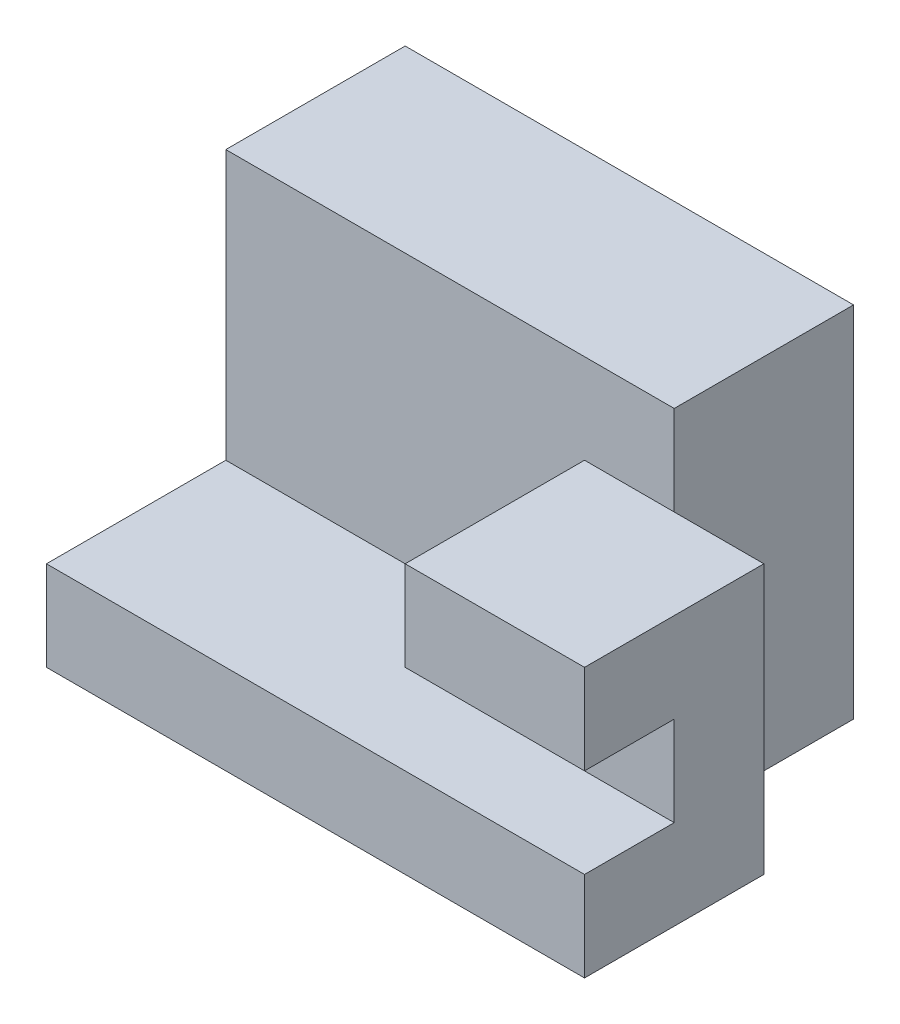
ISO-10303-21;
HEADER;
FILE_DESCRIPTION(('STEP AP214'),'2;1');
FILE_NAME('part.step','',(''),(''),'','','');
FILE_SCHEMA(('AUTOMOTIVE_DESIGN { 1 0 10303 214 1 1 1 1 }'));
ENDSEC;
DATA;
#1=APPLICATION_CONTEXT('core data for automotive mechanical design processes');
#2=APPLICATION_PROTOCOL_DEFINITION('international standard','automotive_design',2000,#1);
#3=PRODUCT_CONTEXT('',#1,'mechanical');
#4=PRODUCT('Part','Part','',(#3));
#5=PRODUCT_RELATED_PRODUCT_CATEGORY('part','',(#4));
#6=PRODUCT_DEFINITION_FORMATION('','',#4);
#7=PRODUCT_DEFINITION_CONTEXT('part definition',#1,'design');
#8=PRODUCT_DEFINITION('design','',#6,#7);
#9=PRODUCT_DEFINITION_SHAPE('','',#8);
#10=(LENGTH_UNIT() NAMED_UNIT(*) SI_UNIT(.MILLI.,.METRE.));
#11=(NAMED_UNIT(*) PLANE_ANGLE_UNIT() SI_UNIT($,.RADIAN.));
#12=(NAMED_UNIT(*) SI_UNIT($,.STERADIAN.) SOLID_ANGLE_UNIT());
#13=UNCERTAINTY_MEASURE_WITH_UNIT(LENGTH_MEASURE(1.E-05),#10,'distance_accuracy_value','');
#14=(GEOMETRIC_REPRESENTATION_CONTEXT(3) GLOBAL_UNCERTAINTY_ASSIGNED_CONTEXT((#13)) GLOBAL_UNIT_ASSIGNED_CONTEXT((#10,
#11,#12)) REPRESENTATION_CONTEXT('',''));
#15=CARTESIAN_POINT('',(0.,0.,0.));
#16=DIRECTION('',(0.,0.,1.));
#17=DIRECTION('',(1.,0.,0.));
#18=AXIS2_PLACEMENT_3D('',#15,#16,#17);
#19=CARTESIAN_POINT('',(0.,4.,0.));
#20=DIRECTION('',(0.,0.,1.));
#21=DIRECTION('',(1.,0.,0.));
#22=AXIS2_PLACEMENT_3D('',#19,#20,#21);
#23=PLANE('',#22);
#24=DIRECTION('',(0.,1.,0.));
#25=VECTOR('',#24,1.);
#26=CARTESIAN_POINT('',(4.,0.,0.));
#27=LINE('',#26,#25);
#28=CARTESIAN_POINT('',(4.,1.,0.));
#29=VERTEX_POINT('',#28);
#30=CARTESIAN_POINT('',(4.,3.,0.));
#31=VERTEX_POINT('',#30);
#32=EDGE_CURVE('E50',#29,#31,#27,.T.);
#33=ORIENTED_EDGE('',*,*,#32,.T.);
#34=DIRECTION('',(1.,0.,0.));
#35=VECTOR('',#34,1.);
#36=CARTESIAN_POINT('',(4.,3.,0.));
#37=LINE('',#36,#35);
#38=CARTESIAN_POINT('',(5.,3.,0.));
#39=VERTEX_POINT('',#38);
#40=EDGE_CURVE('E173',#31,#39,#37,.T.);
#41=ORIENTED_EDGE('',*,*,#40,.T.);
#42=DIRECTION('',(0.,-1.,0.));
#43=VECTOR('',#42,1.);
#44=CARTESIAN_POINT('',(5.,4.,0.));
#45=LINE('',#44,#43);
#46=CARTESIAN_POINT('',(5.,4.,0.));
#47=VERTEX_POINT('',#46);
#48=EDGE_CURVE('E38',#47,#39,#45,.T.);
#49=ORIENTED_EDGE('',*,*,#48,.F.);
#50=DIRECTION('',(-1.,0.,0.));
#51=VECTOR('',#50,1.);
#52=CARTESIAN_POINT('',(0.,4.,0.));
#53=LINE('',#52,#51);
#54=CARTESIAN_POINT('',(0.,4.,0.));
#55=VERTEX_POINT('',#54);
#56=EDGE_CURVE('E199',#47,#55,#53,.T.);
#57=ORIENTED_EDGE('',*,*,#56,.T.);
#58=DIRECTION('',(0.,-1.,0.));
#59=VECTOR('',#58,1.);
#60=CARTESIAN_POINT('',(0.,4.,0.));
#61=LINE('',#60,#59);
#62=CARTESIAN_POINT('',(0.,1.,0.));
#63=VERTEX_POINT('',#62);
#64=EDGE_CURVE('E212',#55,#63,#61,.T.);
#65=ORIENTED_EDGE('',*,*,#64,.T.);
#66=DIRECTION('',(-1.,0.,0.));
#67=VECTOR('',#66,1.);
#68=CARTESIAN_POINT('',(0.,1.,0.));
#69=LINE('',#68,#67);
#70=EDGE_CURVE('E11',#29,#63,#69,.T.);
#71=ORIENTED_EDGE('',*,*,#70,.F.);
#72=EDGE_LOOP('',(#33,#41,#49,#57,#65,#71));
#73=FACE_BOUND('',#72,.T.);
#74=ADVANCED_FACE('F35',(#73),#23,.T.);
#75=CARTESIAN_POINT('',(5.,4.,0.));
#76=DIRECTION('',(1.,0.,0.));
#77=DIRECTION('',(0.,0.,-1.));
#78=AXIS2_PLACEMENT_3D('',#75,#76,#77);
#79=PLANE('',#78);
#80=DIRECTION('',(0.,0.,1.));
#81=VECTOR('',#80,1.);
#82=CARTESIAN_POINT('',(5.,0.,0.));
#83=LINE('',#82,#81);
#84=CARTESIAN_POINT('',(5.,0.,-2.));
#85=VERTEX_POINT('',#84);
#86=CARTESIAN_POINT('',(5.,0.,0.));
#87=VERTEX_POINT('',#86);
#88=EDGE_CURVE('E198',#85,#87,#83,.T.);
#89=ORIENTED_EDGE('',*,*,#88,.F.);
#90=DIRECTION('',(0.,-1.,0.));
#91=VECTOR('',#90,1.);
#92=CARTESIAN_POINT('',(5.,4.,-2.));
#93=LINE('',#92,#91);
#94=CARTESIAN_POINT('',(5.,4.,-2.));
#95=VERTEX_POINT('',#94);
#96=EDGE_CURVE('E223',#95,#85,#93,.T.);
#97=ORIENTED_EDGE('',*,*,#96,.F.);
#98=DIRECTION('',(0.,0.,1.));
#99=VECTOR('',#98,1.);
#100=CARTESIAN_POINT('',(5.,4.,0.));
#101=LINE('',#100,#99);
#102=EDGE_CURVE('E202',#95,#47,#101,.T.);
#103=ORIENTED_EDGE('',*,*,#102,.T.);
#104=ORIENTED_EDGE('',*,*,#48,.T.);
#105=EDGE_CURVE('E58',#39,#87,#45,.T.);
#106=ORIENTED_EDGE('',*,*,#105,.T.);
#107=EDGE_LOOP('',(#89,#97,#103,#104,#106));
#108=FACE_BOUND('',#107,.T.);
#109=ADVANCED_FACE('F230',(#108),#79,.T.);
#110=CARTESIAN_POINT('',(0.,4.,-2.));
#111=DIRECTION('',(0.,0.,-1.));
#112=DIRECTION('',(-1.,0.,0.));
#113=AXIS2_PLACEMENT_3D('',#110,#111,#112);
#114=PLANE('',#113);
#115=DIRECTION('',(1.,0.,0.));
#116=VECTOR('',#115,1.);
#117=CARTESIAN_POINT('',(0.,0.,-2.));
#118=LINE('',#117,#116);
#119=CARTESIAN_POINT('',(0.,0.,-2.));
#120=VERTEX_POINT('',#119);
#121=EDGE_CURVE('E215',#120,#85,#118,.T.);
#122=ORIENTED_EDGE('',*,*,#121,.F.);
#123=DIRECTION('',(0.,-1.,0.));
#124=VECTOR('',#123,1.);
#125=CARTESIAN_POINT('',(0.,4.,-2.));
#126=LINE('',#125,#124);
#127=CARTESIAN_POINT('',(0.,4.,-2.));
#128=VERTEX_POINT('',#127);
#129=EDGE_CURVE('E222',#128,#120,#126,.T.);
#130=ORIENTED_EDGE('',*,*,#129,.F.);
#131=DIRECTION('',(1.,0.,0.));
#132=VECTOR('',#131,1.);
#133=CARTESIAN_POINT('',(0.,4.,-2.));
#134=LINE('',#133,#132);
#135=EDGE_CURVE('E206',#128,#95,#134,.T.);
#136=ORIENTED_EDGE('',*,*,#135,.T.);
#137=ORIENTED_EDGE('',*,*,#96,.T.);
#138=EDGE_LOOP('',(#122,#130,#136,#137));
#139=FACE_BOUND('',#138,.T.);
#140=ADVANCED_FACE('F251',(#139),#114,.T.);
#141=CARTESIAN_POINT('',(0.,4.,0.));
#142=DIRECTION('',(-1.,0.,0.));
#143=DIRECTION('',(0.,0.,1.));
#144=AXIS2_PLACEMENT_3D('',#141,#142,#143);
#145=PLANE('',#144);
#146=DIRECTION('',(0.,0.,-1.));
#147=VECTOR('',#146,1.);
#148=CARTESIAN_POINT('',(0.,0.,0.));
#149=LINE('',#148,#147);
#150=CARTESIAN_POINT('',(0.,0.,2.));
#151=VERTEX_POINT('',#150);
#152=EDGE_CURVE('E203',#151,#120,#149,.T.);
#153=ORIENTED_EDGE('',*,*,#152,.F.);
#154=DIRECTION('',(0.,-1.,0.));
#155=VECTOR('',#154,1.);
#156=CARTESIAN_POINT('',(0.,1.,2.));
#157=LINE('',#156,#155);
#158=CARTESIAN_POINT('',(0.,1.,2.));
#159=VERTEX_POINT('',#158);
#160=EDGE_CURVE('E192',#159,#151,#157,.T.);
#161=ORIENTED_EDGE('',*,*,#160,.F.);
#162=DIRECTION('',(0.,0.,1.));
#163=VECTOR('',#162,1.);
#164=CARTESIAN_POINT('',(0.,1.,0.));
#165=LINE('',#164,#163);
#166=EDGE_CURVE('E178',#63,#159,#165,.T.);
#167=ORIENTED_EDGE('',*,*,#166,.F.);
#168=ORIENTED_EDGE('',*,*,#64,.F.);
#169=DIRECTION('',(0.,0.,-1.));
#170=VECTOR('',#169,1.);
#171=CARTESIAN_POINT('',(0.,4.,0.));
#172=LINE('',#171,#170);
#173=EDGE_CURVE('E209',#55,#128,#172,.T.);
#174=ORIENTED_EDGE('',*,*,#173,.T.);
#175=ORIENTED_EDGE('',*,*,#129,.T.);
#176=EDGE_LOOP('',(#153,#161,#167,#168,#174,#175));
#177=FACE_BOUND('',#176,.T.);
#178=ADVANCED_FACE('F253',(#177),#145,.T.);
#179=CARTESIAN_POINT('',(0.,4.,0.));
#180=DIRECTION('',(0.,1.,0.));
#181=DIRECTION('',(0.,0.,1.));
#182=AXIS2_PLACEMENT_3D('',#179,#180,#181);
#183=PLANE('',#182);
#184=ORIENTED_EDGE('',*,*,#56,.F.);
#185=ORIENTED_EDGE('',*,*,#102,.F.);
#186=ORIENTED_EDGE('',*,*,#135,.F.);
#187=ORIENTED_EDGE('',*,*,#173,.F.);
#188=EDGE_LOOP('',(#184,#185,#186,#187));
#189=FACE_BOUND('',#188,.T.);
#190=ADVANCED_FACE('F249',(#189),#183,.T.);
#191=CARTESIAN_POINT('',(0.,0.,0.));
#192=DIRECTION('',(0.,1.,0.));
#193=DIRECTION('',(0.,0.,1.));
#194=AXIS2_PLACEMENT_3D('',#191,#192,#193);
#195=PLANE('',#194);
#196=ORIENTED_EDGE('',*,*,#88,.T.);
#197=DIRECTION('',(-1.,0.,0.));
#198=VECTOR('',#197,1.);
#199=CARTESIAN_POINT('',(0.,0.,0.));
#200=LINE('',#199,#198);
#201=CARTESIAN_POINT('',(6.,0.,0.));
#202=VERTEX_POINT('',#201);
#203=EDGE_CURVE('E187',#202,#87,#200,.T.);
#204=ORIENTED_EDGE('',*,*,#203,.F.);
#205=DIRECTION('',(0.,0.,-1.));
#206=VECTOR('',#205,1.);
#207=CARTESIAN_POINT('',(6.,0.,0.));
#208=LINE('',#207,#206);
#209=CARTESIAN_POINT('',(6.,0.,2.));
#210=VERTEX_POINT('',#209);
#211=EDGE_CURVE('E169',#210,#202,#208,.T.);
#212=ORIENTED_EDGE('',*,*,#211,.F.);
#213=DIRECTION('',(1.,0.,0.));
#214=VECTOR('',#213,1.);
#215=CARTESIAN_POINT('',(0.,0.,2.));
#216=LINE('',#215,#214);
#217=EDGE_CURVE('E179',#151,#210,#216,.T.);
#218=ORIENTED_EDGE('',*,*,#217,.F.);
#219=ORIENTED_EDGE('',*,*,#152,.T.);
#220=ORIENTED_EDGE('',*,*,#121,.T.);
#221=EDGE_LOOP('',(#196,#204,#212,#218,#219,#220));
#222=FACE_BOUND('',#221,.T.);
#223=ADVANCED_FACE('F246',(#222),#195,.F.);
#224=CARTESIAN_POINT('',(6.,1.,0.));
#225=DIRECTION('',(-1.,0.,0.));
#226=DIRECTION('',(0.,0.,1.));
#227=AXIS2_PLACEMENT_3D('',#224,#225,#226);
#228=PLANE('',#227);
#229=ORIENTED_EDGE('',*,*,#211,.T.);
#230=DIRECTION('',(0.,-1.,0.));
#231=VECTOR('',#230,1.);
#232=CARTESIAN_POINT('',(6.,1.,0.));
#233=LINE('',#232,#231);
#234=CARTESIAN_POINT('',(6.,3.,0.));
#235=VERTEX_POINT('',#234);
#236=EDGE_CURVE('E195',#235,#202,#233,.T.);
#237=ORIENTED_EDGE('',*,*,#236,.F.);
#238=DIRECTION('',(0.,0.,-1.));
#239=VECTOR('',#238,1.);
#240=CARTESIAN_POINT('',(6.,3.,0.));
#241=LINE('',#240,#239);
#242=CARTESIAN_POINT('',(6.,3.,2.));
#243=VERTEX_POINT('',#242);
#244=EDGE_CURVE('E164',#243,#235,#241,.T.);
#245=ORIENTED_EDGE('',*,*,#244,.F.);
#246=DIRECTION('',(0.,1.,0.));
#247=VECTOR('',#246,1.);
#248=CARTESIAN_POINT('',(6.,0.,2.));
#249=LINE('',#248,#247);
#250=CARTESIAN_POINT('',(6.,2.,2.));
#251=VERTEX_POINT('',#250);
#252=EDGE_CURVE('E149',#251,#243,#249,.T.);
#253=ORIENTED_EDGE('',*,*,#252,.F.);
#254=DIRECTION('',(0.,0.,1.));
#255=VECTOR('',#254,1.);
#256=CARTESIAN_POINT('',(6.,2.,0.));
#257=LINE('',#256,#255);
#258=CARTESIAN_POINT('',(6.,2.,0.999999999999999));
#259=VERTEX_POINT('',#258);
#260=EDGE_CURVE('E161',#259,#251,#257,.T.);
#261=ORIENTED_EDGE('',*,*,#260,.F.);
#262=DIRECTION('',(0.,-1.,0.));
#263=VECTOR('',#262,1.);
#264=CARTESIAN_POINT('',(6.,0.,1.));
#265=LINE('',#264,#263);
#266=CARTESIAN_POINT('',(6.,1.,0.999999999999999));
#267=VERTEX_POINT('',#266);
#268=EDGE_CURVE('E135',#259,#267,#265,.T.);
#269=ORIENTED_EDGE('',*,*,#268,.T.);
#270=DIRECTION('',(0.,0.,-1.));
#271=VECTOR('',#270,1.);
#272=CARTESIAN_POINT('',(6.,1.,0.));
#273=LINE('',#272,#271);
#274=CARTESIAN_POINT('',(6.,1.,2.));
#275=VERTEX_POINT('',#274);
#276=EDGE_CURVE('E177',#275,#267,#273,.T.);
#277=ORIENTED_EDGE('',*,*,#276,.F.);
#278=DIRECTION('',(0.,-1.,0.));
#279=VECTOR('',#278,1.);
#280=CARTESIAN_POINT('',(6.,1.,2.));
#281=LINE('',#280,#279);
#282=EDGE_CURVE('E184',#275,#210,#281,.T.);
#283=ORIENTED_EDGE('',*,*,#282,.T.);
#284=EDGE_LOOP('',(#229,#237,#245,#253,#261,#269,#277,#283));
#285=FACE_BOUND('',#284,.T.);
#286=ADVANCED_FACE('F241',(#285),#228,.F.);
#287=CARTESIAN_POINT('',(0.,1.,0.));
#288=DIRECTION('',(0.,0.,1.));
#289=DIRECTION('',(1.,0.,0.));
#290=AXIS2_PLACEMENT_3D('',#287,#288,#289);
#291=PLANE('',#290);
#292=ORIENTED_EDGE('',*,*,#105,.F.);
#293=EDGE_CURVE('E175',#39,#235,#37,.T.);
#294=ORIENTED_EDGE('',*,*,#293,.T.);
#295=ORIENTED_EDGE('',*,*,#236,.T.);
#296=ORIENTED_EDGE('',*,*,#203,.T.);
#297=EDGE_LOOP('',(#292,#294,#295,#296));
#298=FACE_BOUND('',#297,.T.);
#299=ADVANCED_FACE('F238',(#298),#291,.F.);
#300=CARTESIAN_POINT('',(0.,1.,2.));
#301=DIRECTION('',(0.,0.,-1.));
#302=DIRECTION('',(-1.,0.,0.));
#303=AXIS2_PLACEMENT_3D('',#300,#301,#302);
#304=PLANE('',#303);
#305=ORIENTED_EDGE('',*,*,#217,.T.);
#306=ORIENTED_EDGE('',*,*,#282,.F.);
#307=DIRECTION('',(1.,0.,0.));
#308=VECTOR('',#307,1.);
#309=CARTESIAN_POINT('',(0.,1.,2.));
#310=LINE('',#309,#308);
#311=EDGE_CURVE('E182',#159,#275,#310,.T.);
#312=ORIENTED_EDGE('',*,*,#311,.F.);
#313=ORIENTED_EDGE('',*,*,#160,.T.);
#314=EDGE_LOOP('',(#305,#306,#312,#313));
#315=FACE_BOUND('',#314,.T.);
#316=ADVANCED_FACE('F275',(#315),#304,.F.);
#317=CARTESIAN_POINT('',(0.,1.,0.));
#318=DIRECTION('',(0.,1.,0.));
#319=DIRECTION('',(0.,0.,1.));
#320=AXIS2_PLACEMENT_3D('',#317,#318,#319);
#321=PLANE('',#320);
#322=DIRECTION('',(1.,0.,0.));
#323=VECTOR('',#322,1.);
#324=CARTESIAN_POINT('',(4.,1.,1.));
#325=LINE('',#324,#323);
#326=CARTESIAN_POINT('',(4.,1.,1.));
#327=VERTEX_POINT('',#326);
#328=EDGE_CURVE('E139',#327,#267,#325,.T.);
#329=ORIENTED_EDGE('',*,*,#328,.F.);
#330=DIRECTION('',(0.,0.,1.));
#331=VECTOR('',#330,1.);
#332=CARTESIAN_POINT('',(4.,1.,0.));
#333=LINE('',#332,#331);
#334=EDGE_CURVE('E153',#29,#327,#333,.T.);
#335=ORIENTED_EDGE('',*,*,#334,.F.);
#336=ORIENTED_EDGE('',*,*,#70,.T.);
#337=ORIENTED_EDGE('',*,*,#166,.T.);
#338=ORIENTED_EDGE('',*,*,#311,.T.);
#339=ORIENTED_EDGE('',*,*,#276,.T.);
#340=EDGE_LOOP('',(#329,#335,#336,#337,#338,#339));
#341=FACE_BOUND('',#340,.T.);
#342=ADVANCED_FACE('F278',(#341),#321,.T.);
#343=CARTESIAN_POINT('',(4.,2.,0.));
#344=DIRECTION('',(0.,1.,0.));
#345=DIRECTION('',(0.,0.,1.));
#346=AXIS2_PLACEMENT_3D('',#343,#344,#345);
#347=PLANE('',#346);
#348=ORIENTED_EDGE('',*,*,#260,.T.);
#349=DIRECTION('',(1.,0.,0.));
#350=VECTOR('',#349,1.);
#351=CARTESIAN_POINT('',(4.,2.,2.));
#352=LINE('',#351,#350);
#353=CARTESIAN_POINT('',(4.,2.,2.));
#354=VERTEX_POINT('',#353);
#355=EDGE_CURVE('E147',#354,#251,#352,.T.);
#356=ORIENTED_EDGE('',*,*,#355,.F.);
#357=DIRECTION('',(0.,0.,1.));
#358=VECTOR('',#357,1.);
#359=CARTESIAN_POINT('',(4.,2.,0.));
#360=LINE('',#359,#358);
#361=CARTESIAN_POINT('',(4.,2.,0.999999999999999));
#362=VERTEX_POINT('',#361);
#363=EDGE_CURVE('E144',#362,#354,#360,.T.);
#364=ORIENTED_EDGE('',*,*,#363,.F.);
#365=DIRECTION('',(1.,0.,0.));
#366=VECTOR('',#365,1.);
#367=CARTESIAN_POINT('',(4.,2.,0.999999999999999));
#368=LINE('',#367,#366);
#369=EDGE_CURVE('E128',#362,#259,#368,.T.);
#370=ORIENTED_EDGE('',*,*,#369,.T.);
#371=EDGE_LOOP('',(#348,#356,#364,#370));
#372=FACE_BOUND('',#371,.T.);
#373=ADVANCED_FACE('F145',(#372),#347,.F.);
#374=CARTESIAN_POINT('',(4.,0.,2.));
#375=DIRECTION('',(0.,0.,-1.));
#376=DIRECTION('',(-1.,0.,0.));
#377=AXIS2_PLACEMENT_3D('',#374,#375,#376);
#378=PLANE('',#377);
#379=ORIENTED_EDGE('',*,*,#252,.T.);
#380=DIRECTION('',(1.,0.,0.));
#381=VECTOR('',#380,1.);
#382=CARTESIAN_POINT('',(4.,3.,2.));
#383=LINE('',#382,#381);
#384=CARTESIAN_POINT('',(4.,3.,2.));
#385=VERTEX_POINT('',#384);
#386=EDGE_CURVE('E170',#385,#243,#383,.T.);
#387=ORIENTED_EDGE('',*,*,#386,.F.);
#388=DIRECTION('',(0.,1.,0.));
#389=VECTOR('',#388,1.);
#390=CARTESIAN_POINT('',(4.,0.,2.));
#391=LINE('',#390,#389);
#392=EDGE_CURVE('E140',#354,#385,#391,.T.);
#393=ORIENTED_EDGE('',*,*,#392,.F.);
#394=ORIENTED_EDGE('',*,*,#355,.T.);
#395=EDGE_LOOP('',(#379,#387,#393,#394));
#396=FACE_BOUND('',#395,.T.);
#397=ADVANCED_FACE('F285',(#396),#378,.F.);
#398=CARTESIAN_POINT('',(4.,3.,0.));
#399=DIRECTION('',(0.,-1.,0.));
#400=DIRECTION('',(0.,0.,-1.));
#401=AXIS2_PLACEMENT_3D('',#398,#399,#400);
#402=PLANE('',#401);
#403=ORIENTED_EDGE('',*,*,#244,.T.);
#404=ORIENTED_EDGE('',*,*,#293,.F.);
#405=ORIENTED_EDGE('',*,*,#40,.F.);
#406=DIRECTION('',(0.,0.,-1.));
#407=VECTOR('',#406,1.);
#408=CARTESIAN_POINT('',(4.,3.,0.));
#409=LINE('',#408,#407);
#410=EDGE_CURVE('E158',#385,#31,#409,.T.);
#411=ORIENTED_EDGE('',*,*,#410,.F.);
#412=ORIENTED_EDGE('',*,*,#386,.T.);
#413=EDGE_LOOP('',(#403,#404,#405,#411,#412));
#414=FACE_BOUND('',#413,.T.);
#415=ADVANCED_FACE('F235',(#414),#402,.F.);
#416=CARTESIAN_POINT('',(4.,0.,1.));
#417=DIRECTION('',(0.,0.,1.));
#418=DIRECTION('',(0.,-1.,0.));
#419=AXIS2_PLACEMENT_3D('',#416,#417,#418);
#420=PLANE('',#419);
#421=ORIENTED_EDGE('',*,*,#268,.F.);
#422=ORIENTED_EDGE('',*,*,#369,.F.);
#423=DIRECTION('',(0.,-1.,0.));
#424=VECTOR('',#423,1.);
#425=CARTESIAN_POINT('',(4.,0.,1.));
#426=LINE('',#425,#424);
#427=EDGE_CURVE('E133',#362,#327,#426,.T.);
#428=ORIENTED_EDGE('',*,*,#427,.T.);
#429=ORIENTED_EDGE('',*,*,#328,.T.);
#430=EDGE_LOOP('',(#421,#422,#428,#429));
#431=FACE_BOUND('',#430,.T.);
#432=ADVANCED_FACE('F130',(#431),#420,.T.);
#433=CARTESIAN_POINT('',(4.,0.,0.));
#434=DIRECTION('',(1.,0.,0.));
#435=DIRECTION('',(0.,0.,-1.));
#436=AXIS2_PLACEMENT_3D('',#433,#434,#435);
#437=PLANE('',#436);
#438=ORIENTED_EDGE('',*,*,#363,.T.);
#439=ORIENTED_EDGE('',*,*,#392,.T.);
#440=ORIENTED_EDGE('',*,*,#410,.T.);
#441=ORIENTED_EDGE('',*,*,#32,.F.);
#442=ORIENTED_EDGE('',*,*,#334,.T.);
#443=ORIENTED_EDGE('',*,*,#427,.F.);
#444=EDGE_LOOP('',(#438,#439,#440,#441,#442,#443));
#445=FACE_BOUND('',#444,.T.);
#446=ADVANCED_FACE('F152',(#445),#437,.F.);
#447=CLOSED_SHELL('',(#74,#109,#140,#178,#190,#223,#286,#299,#316,#342,#373,#397,#415,#432,#446));
#448=MANIFOLD_SOLID_BREP('B2',#447);
#449=ADVANCED_BREP_SHAPE_REPRESENTATION('',(#18,#448),#14);
#450=SHAPE_DEFINITION_REPRESENTATION(#9,#449);
ENDSEC;
END-ISO-10303-21;
